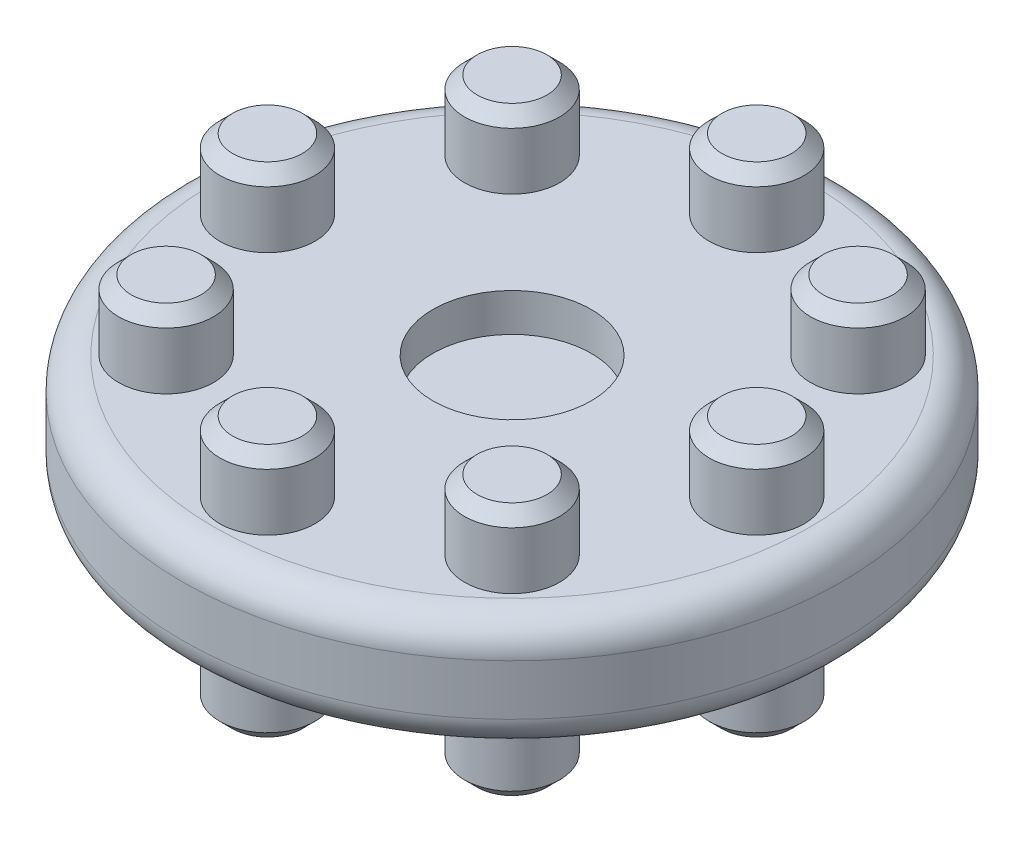
ISO-10303-21;
HEADER;
FILE_DESCRIPTION(('STEP AP214'),'2;1');
FILE_NAME('part.step','',(''),(''),'','','');
FILE_SCHEMA(('AUTOMOTIVE_DESIGN { 1 0 10303 214 1 1 1 1 }'));
ENDSEC;
DATA;
#1=APPLICATION_CONTEXT('core data for automotive mechanical design processes');
#2=APPLICATION_PROTOCOL_DEFINITION('international standard','automotive_design',2000,#1);
#3=PRODUCT_CONTEXT('',#1,'mechanical');
#4=PRODUCT('Part','Part','',(#3));
#5=PRODUCT_RELATED_PRODUCT_CATEGORY('part','',(#4));
#6=PRODUCT_DEFINITION_FORMATION('','',#4);
#7=PRODUCT_DEFINITION_CONTEXT('part definition',#1,'design');
#8=PRODUCT_DEFINITION('design','',#6,#7);
#9=PRODUCT_DEFINITION_SHAPE('','',#8);
#10=(LENGTH_UNIT() NAMED_UNIT(*) SI_UNIT(.MILLI.,.METRE.));
#11=(NAMED_UNIT(*) PLANE_ANGLE_UNIT() SI_UNIT($,.RADIAN.));
#12=(NAMED_UNIT(*) SI_UNIT($,.STERADIAN.) SOLID_ANGLE_UNIT());
#13=UNCERTAINTY_MEASURE_WITH_UNIT(LENGTH_MEASURE(1.E-05),#10,'distance_accuracy_value','');
#14=(GEOMETRIC_REPRESENTATION_CONTEXT(3) GLOBAL_UNCERTAINTY_ASSIGNED_CONTEXT((#13)) GLOBAL_UNIT_ASSIGNED_CONTEXT((#10,
#11,#12)) REPRESENTATION_CONTEXT('',''));
#15=CARTESIAN_POINT('',(0.,0.,0.));
#16=DIRECTION('',(0.,0.,1.));
#17=DIRECTION('',(1.,0.,0.));
#18=AXIS2_PLACEMENT_3D('',#15,#16,#17);
#19=CARTESIAN_POINT('',(0.,9.,0.));
#20=DIRECTION('',(0.,-1.,0.));
#21=DIRECTION('',(0.,0.,-1.));
#22=AXIS2_PLACEMENT_3D('',#19,#20,#21);
#23=CYLINDRICAL_SURFACE('',#22,26.);
#24=CARTESIAN_POINT('',(0.,2.5,0.));
#25=DIRECTION('',(0.,1.,0.));
#26=DIRECTION('',(0.,0.,1.));
#27=AXIS2_PLACEMENT_3D('',#24,#25,#26);
#28=CIRCLE('',#27,26.);
#29=CARTESIAN_POINT('',(0.,2.5,26.));
#30=VERTEX_POINT('',#29);
#31=EDGE_CURVE('E52',#30,#30,#28,.T.);
#32=ORIENTED_EDGE('',*,*,#31,.T.);
#33=EDGE_LOOP('',(#32));
#34=FACE_BOUND('',#33,.T.);
#35=CARTESIAN_POINT('',(0.,6.5,0.));
#36=DIRECTION('',(0.,1.,0.));
#37=DIRECTION('',(0.,0.,1.));
#38=AXIS2_PLACEMENT_3D('',#35,#36,#37);
#39=CIRCLE('',#38,26.);
#40=CARTESIAN_POINT('',(0.,6.5,26.));
#41=VERTEX_POINT('',#40);
#42=EDGE_CURVE('E57',#41,#41,#39,.F.);
#43=ORIENTED_EDGE('',*,*,#42,.T.);
#44=EDGE_LOOP('',(#43));
#45=FACE_BOUND('',#44,.T.);
#46=ADVANCED_FACE('F39',(#34,#45),#23,.T.);
#47=CARTESIAN_POINT('',(0.,9.,0.));
#48=DIRECTION('',(0.,1.,0.));
#49=DIRECTION('',(0.,0.,1.));
#50=AXIS2_PLACEMENT_3D('',#47,#48,#49);
#51=PLANE('',#50);
#52=CARTESIAN_POINT('',(0.,9.,0.));
#53=DIRECTION('',(0.,1.,0.));
#54=DIRECTION('',(0.,0.,1.));
#55=AXIS2_PLACEMENT_3D('',#52,#53,#54);
#56=CIRCLE('',#55,23.5);
#57=CARTESIAN_POINT('',(0.,9.,23.5));
#58=VERTEX_POINT('',#57);
#59=EDGE_CURVE('E10',#58,#58,#56,.T.);
#60=ORIENTED_EDGE('',*,*,#59,.T.);
#61=EDGE_LOOP('',(#60));
#62=FACE_BOUND('',#61,.T.);
#63=CARTESIAN_POINT('',(-13.6471608769004,9.,13.6471608769004));
#64=DIRECTION('',(0.,1.,0.));
#65=DIRECTION('',(0.,0.,1.));
#66=AXIS2_PLACEMENT_3D('',#63,#64,#65);
#67=CIRCLE('',#66,3.75);
#68=CARTESIAN_POINT('',(-13.6471608769004,9.,17.3971608769004));
#69=VERTEX_POINT('',#68);
#70=EDGE_CURVE('E267',#69,#69,#67,.T.);
#71=ORIENTED_EDGE('',*,*,#70,.F.);
#72=EDGE_LOOP('',(#71));
#73=FACE_BOUND('',#72,.T.);
#74=CARTESIAN_POINT('',(-19.3,9.,0.));
#75=DIRECTION('',(0.,1.,0.));
#76=DIRECTION('',(0.,0.,1.));
#77=AXIS2_PLACEMENT_3D('',#74,#75,#76);
#78=CIRCLE('',#77,3.75);
#79=CARTESIAN_POINT('',(-19.3,9.,3.75));
#80=VERTEX_POINT('',#79);
#81=EDGE_CURVE('E263',#80,#80,#78,.T.);
#82=ORIENTED_EDGE('',*,*,#81,.F.);
#83=EDGE_LOOP('',(#82));
#84=FACE_BOUND('',#83,.T.);
#85=CARTESIAN_POINT('',(13.6471608769004,9.,13.6471608769004));
#86=DIRECTION('',(0.,1.,0.));
#87=DIRECTION('',(0.,0.,1.));
#88=AXIS2_PLACEMENT_3D('',#85,#86,#87);
#89=CIRCLE('',#88,3.75);
#90=CARTESIAN_POINT('',(13.6471608769004,9.,17.3971608769004));
#91=VERTEX_POINT('',#90);
#92=EDGE_CURVE('E259',#91,#91,#89,.T.);
#93=ORIENTED_EDGE('',*,*,#92,.F.);
#94=EDGE_LOOP('',(#93));
#95=FACE_BOUND('',#94,.T.);
#96=CARTESIAN_POINT('',(0.,9.,19.3));
#97=DIRECTION('',(0.,1.,0.));
#98=DIRECTION('',(0.,0.,1.));
#99=AXIS2_PLACEMENT_3D('',#96,#97,#98);
#100=CIRCLE('',#99,3.75);
#101=CARTESIAN_POINT('',(0.,9.,23.05));
#102=VERTEX_POINT('',#101);
#103=EDGE_CURVE('E255',#102,#102,#100,.T.);
#104=ORIENTED_EDGE('',*,*,#103,.F.);
#105=EDGE_LOOP('',(#104));
#106=FACE_BOUND('',#105,.T.);
#107=CARTESIAN_POINT('',(-13.6471608769,9.,-13.6471608769002));
#108=DIRECTION('',(0.,1.,0.));
#109=DIRECTION('',(0.,0.,1.));
#110=AXIS2_PLACEMENT_3D('',#107,#108,#109);
#111=CIRCLE('',#110,3.75);
#112=CARTESIAN_POINT('',(-13.6471608769,9.,-9.89716087690015));
#113=VERTEX_POINT('',#112);
#114=EDGE_CURVE('E251',#113,#113,#111,.T.);
#115=ORIENTED_EDGE('',*,*,#114,.F.);
#116=EDGE_LOOP('',(#115));
#117=FACE_BOUND('',#116,.T.);
#118=CARTESIAN_POINT('',(0.,9.,-19.3));
#119=DIRECTION('',(0.,1.,0.));
#120=DIRECTION('',(0.,0.,1.));
#121=AXIS2_PLACEMENT_3D('',#118,#119,#120);
#122=CIRCLE('',#121,3.75);
#123=CARTESIAN_POINT('',(0.,9.,-15.55));
#124=VERTEX_POINT('',#123);
#125=EDGE_CURVE('E247',#124,#124,#122,.T.);
#126=ORIENTED_EDGE('',*,*,#125,.F.);
#127=EDGE_LOOP('',(#126));
#128=FACE_BOUND('',#127,.T.);
#129=CARTESIAN_POINT('',(13.6471608769005,9.,-13.6471608769007));
#130=DIRECTION('',(0.,1.,0.));
#131=DIRECTION('',(0.,0.,1.));
#132=AXIS2_PLACEMENT_3D('',#129,#130,#131);
#133=CIRCLE('',#132,3.75);
#134=CARTESIAN_POINT('',(13.6471608769005,9.,-9.89716087690073));
#135=VERTEX_POINT('',#134);
#136=EDGE_CURVE('E243',#135,#135,#133,.T.);
#137=ORIENTED_EDGE('',*,*,#136,.F.);
#138=EDGE_LOOP('',(#137));
#139=FACE_BOUND('',#138,.T.);
#140=CARTESIAN_POINT('',(19.3,9.,0.));
#141=DIRECTION('',(0.,1.,0.));
#142=DIRECTION('',(0.,0.,1.));
#143=AXIS2_PLACEMENT_3D('',#140,#141,#142);
#144=CIRCLE('',#143,3.75);
#145=CARTESIAN_POINT('',(19.3,9.,3.75));
#146=VERTEX_POINT('',#145);
#147=EDGE_CURVE('E239',#146,#146,#144,.T.);
#148=ORIENTED_EDGE('',*,*,#147,.F.);
#149=EDGE_LOOP('',(#148));
#150=FACE_BOUND('',#149,.T.);
#151=CARTESIAN_POINT('',(0.,9.,0.));
#152=DIRECTION('',(0.,1.,0.));
#153=DIRECTION('',(0.,0.,1.));
#154=AXIS2_PLACEMENT_3D('',#151,#152,#153);
#155=CIRCLE('',#154,6.25);
#156=CARTESIAN_POINT('',(0.,9.,6.25));
#157=VERTEX_POINT('',#156);
#158=EDGE_CURVE('E200',#157,#157,#155,.T.);
#159=ORIENTED_EDGE('',*,*,#158,.F.);
#160=EDGE_LOOP('',(#159));
#161=FACE_BOUND('',#160,.T.);
#162=ADVANCED_FACE('F274',(#62,#73,#84,#95,#106,#117,#128,#139,#150,#161),#51,.T.);
#163=CARTESIAN_POINT('',(0.,0.,0.));
#164=DIRECTION('',(0.,1.,0.));
#165=DIRECTION('',(0.,0.,1.));
#166=AXIS2_PLACEMENT_3D('',#163,#164,#165);
#167=PLANE('',#166);
#168=CARTESIAN_POINT('',(0.,0.,0.));
#169=DIRECTION('',(0.,1.,0.));
#170=DIRECTION('',(0.,0.,1.));
#171=AXIS2_PLACEMENT_3D('',#168,#169,#170);
#172=CIRCLE('',#171,23.5);
#173=CARTESIAN_POINT('',(0.,0.,23.5));
#174=VERTEX_POINT('',#173);
#175=EDGE_CURVE('E47',#174,#174,#172,.F.);
#176=ORIENTED_EDGE('',*,*,#175,.T.);
#177=EDGE_LOOP('',(#176));
#178=FACE_BOUND('',#177,.T.);
#179=CARTESIAN_POINT('',(-19.3,0.,0.));
#180=DIRECTION('',(0.,1.,0.));
#181=DIRECTION('',(0.,0.,1.));
#182=AXIS2_PLACEMENT_3D('',#179,#180,#181);
#183=CIRCLE('',#182,3.75);
#184=CARTESIAN_POINT('',(-19.3,0.,3.75));
#185=VERTEX_POINT('',#184);
#186=EDGE_CURVE('E235',#185,#185,#183,.T.);
#187=ORIENTED_EDGE('',*,*,#186,.T.);
#188=EDGE_LOOP('',(#187));
#189=FACE_BOUND('',#188,.T.);
#190=CARTESIAN_POINT('',(-13.6471608769004,0.,13.6471608769004));
#191=DIRECTION('',(0.,1.,0.));
#192=DIRECTION('',(0.,0.,1.));
#193=AXIS2_PLACEMENT_3D('',#190,#191,#192);
#194=CIRCLE('',#193,3.75);
#195=CARTESIAN_POINT('',(-13.6471608769004,0.,17.3971608769004));
#196=VERTEX_POINT('',#195);
#197=EDGE_CURVE('E231',#196,#196,#194,.T.);
#198=ORIENTED_EDGE('',*,*,#197,.T.);
#199=EDGE_LOOP('',(#198));
#200=FACE_BOUND('',#199,.T.);
#201=CARTESIAN_POINT('',(0.,0.,19.3));
#202=DIRECTION('',(0.,1.,0.));
#203=DIRECTION('',(0.,0.,1.));
#204=AXIS2_PLACEMENT_3D('',#201,#202,#203);
#205=CIRCLE('',#204,3.75);
#206=CARTESIAN_POINT('',(0.,0.,23.05));
#207=VERTEX_POINT('',#206);
#208=EDGE_CURVE('E227',#207,#207,#205,.T.);
#209=ORIENTED_EDGE('',*,*,#208,.T.);
#210=EDGE_LOOP('',(#209));
#211=FACE_BOUND('',#210,.T.);
#212=CARTESIAN_POINT('',(13.6471608769004,0.,13.6471608769004));
#213=DIRECTION('',(0.,1.,0.));
#214=DIRECTION('',(0.,0.,1.));
#215=AXIS2_PLACEMENT_3D('',#212,#213,#214);
#216=CIRCLE('',#215,3.75);
#217=CARTESIAN_POINT('',(13.6471608769004,0.,17.3971608769004));
#218=VERTEX_POINT('',#217);
#219=EDGE_CURVE('E223',#218,#218,#216,.T.);
#220=ORIENTED_EDGE('',*,*,#219,.T.);
#221=EDGE_LOOP('',(#220));
#222=FACE_BOUND('',#221,.T.);
#223=CARTESIAN_POINT('',(19.3,0.,0.));
#224=DIRECTION('',(0.,1.,0.));
#225=DIRECTION('',(0.,0.,1.));
#226=AXIS2_PLACEMENT_3D('',#223,#224,#225);
#227=CIRCLE('',#226,3.75);
#228=CARTESIAN_POINT('',(19.3,0.,3.75));
#229=VERTEX_POINT('',#228);
#230=EDGE_CURVE('E219',#229,#229,#227,.T.);
#231=ORIENTED_EDGE('',*,*,#230,.T.);
#232=EDGE_LOOP('',(#231));
#233=FACE_BOUND('',#232,.T.);
#234=CARTESIAN_POINT('',(13.6471608769005,0.,-13.6471608769007));
#235=DIRECTION('',(0.,1.,0.));
#236=DIRECTION('',(0.,0.,1.));
#237=AXIS2_PLACEMENT_3D('',#234,#235,#236);
#238=CIRCLE('',#237,3.75);
#239=CARTESIAN_POINT('',(13.6471608769005,0.,-9.89716087690073));
#240=VERTEX_POINT('',#239);
#241=EDGE_CURVE('E215',#240,#240,#238,.T.);
#242=ORIENTED_EDGE('',*,*,#241,.T.);
#243=EDGE_LOOP('',(#242));
#244=FACE_BOUND('',#243,.T.);
#245=CARTESIAN_POINT('',(0.,0.,-19.3));
#246=DIRECTION('',(0.,1.,0.));
#247=DIRECTION('',(0.,0.,1.));
#248=AXIS2_PLACEMENT_3D('',#245,#246,#247);
#249=CIRCLE('',#248,3.75);
#250=CARTESIAN_POINT('',(0.,0.,-15.55));
#251=VERTEX_POINT('',#250);
#252=EDGE_CURVE('E211',#251,#251,#249,.T.);
#253=ORIENTED_EDGE('',*,*,#252,.T.);
#254=EDGE_LOOP('',(#253));
#255=FACE_BOUND('',#254,.T.);
#256=CARTESIAN_POINT('',(-13.6471608769,0.,-13.6471608769002));
#257=DIRECTION('',(0.,1.,0.));
#258=DIRECTION('',(0.,0.,1.));
#259=AXIS2_PLACEMENT_3D('',#256,#257,#258);
#260=CIRCLE('',#259,3.75);
#261=CARTESIAN_POINT('',(-13.6471608769,0.,-9.89716087690015));
#262=VERTEX_POINT('',#261);
#263=EDGE_CURVE('E204',#262,#262,#260,.T.);
#264=ORIENTED_EDGE('',*,*,#263,.T.);
#265=EDGE_LOOP('',(#264));
#266=FACE_BOUND('',#265,.T.);
#267=CARTESIAN_POINT('',(0.,0.,0.));
#268=DIRECTION('',(0.,-1.,0.));
#269=DIRECTION('',(0.,0.,-1.));
#270=AXIS2_PLACEMENT_3D('',#267,#268,#269);
#271=CIRCLE('',#270,6.1);
#272=CARTESIAN_POINT('',(0.,0.,-6.1));
#273=VERTEX_POINT('',#272);
#274=EDGE_CURVE('E192',#273,#273,#271,.T.);
#275=ORIENTED_EDGE('',*,*,#274,.F.);
#276=EDGE_LOOP('',(#275));
#277=FACE_BOUND('',#276,.T.);
#278=ADVANCED_FACE('F277',(#178,#189,#200,#211,#222,#233,#244,#255,#266,#277),#167,.F.);
#279=CARTESIAN_POINT('',(0.,3.,0.));
#280=DIRECTION('',(0.,-1.,0.));
#281=DIRECTION('',(0.,0.,-1.));
#282=AXIS2_PLACEMENT_3D('',#279,#280,#281);
#283=CYLINDRICAL_SURFACE('',#282,6.1);
#284=CARTESIAN_POINT('',(0.,3.,0.));
#285=DIRECTION('',(0.,-1.,0.));
#286=DIRECTION('',(0.,0.,-1.));
#287=AXIS2_PLACEMENT_3D('',#284,#285,#286);
#288=CIRCLE('',#287,6.1);
#289=CARTESIAN_POINT('',(0.,3.,-6.1));
#290=VERTEX_POINT('',#289);
#291=EDGE_CURVE('E191',#290,#290,#288,.T.);
#292=ORIENTED_EDGE('',*,*,#291,.F.);
#293=EDGE_LOOP('',(#292));
#294=FACE_BOUND('',#293,.T.);
#295=ORIENTED_EDGE('',*,*,#274,.T.);
#296=EDGE_LOOP('',(#295));
#297=FACE_BOUND('',#296,.T.);
#298=ADVANCED_FACE('F308',(#294,#297),#283,.F.);
#299=CARTESIAN_POINT('',(0.,3.,0.));
#300=DIRECTION('',(0.,-1.,0.));
#301=DIRECTION('',(0.,0.,-1.));
#302=AXIS2_PLACEMENT_3D('',#299,#300,#301);
#303=PLANE('',#302);
#304=ORIENTED_EDGE('',*,*,#291,.T.);
#305=EDGE_LOOP('',(#304));
#306=FACE_BOUND('',#305,.T.);
#307=ADVANCED_FACE('F298',(#306),#303,.T.);
#308=CARTESIAN_POINT('',(0.,6.,0.));
#309=DIRECTION('',(0.,1.,0.));
#310=DIRECTION('',(0.,0.,1.));
#311=AXIS2_PLACEMENT_3D('',#308,#309,#310);
#312=CYLINDRICAL_SURFACE('',#311,6.25);
#313=CARTESIAN_POINT('',(0.,6.,0.));
#314=DIRECTION('',(0.,1.,0.));
#315=DIRECTION('',(0.,0.,1.));
#316=AXIS2_PLACEMENT_3D('',#313,#314,#315);
#317=CIRCLE('',#316,6.25);
#318=CARTESIAN_POINT('',(0.,6.,6.25));
#319=VERTEX_POINT('',#318);
#320=EDGE_CURVE('E196',#319,#319,#317,.T.);
#321=ORIENTED_EDGE('',*,*,#320,.F.);
#322=EDGE_LOOP('',(#321));
#323=FACE_BOUND('',#322,.T.);
#324=ORIENTED_EDGE('',*,*,#158,.T.);
#325=EDGE_LOOP('',(#324));
#326=FACE_BOUND('',#325,.T.);
#327=ADVANCED_FACE('F295',(#323,#326),#312,.F.);
#328=CARTESIAN_POINT('',(0.,6.,0.));
#329=DIRECTION('',(0.,1.,0.));
#330=DIRECTION('',(0.,0.,1.));
#331=AXIS2_PLACEMENT_3D('',#328,#329,#330);
#332=PLANE('',#331);
#333=ORIENTED_EDGE('',*,*,#320,.T.);
#334=EDGE_LOOP('',(#333));
#335=FACE_BOUND('',#334,.T.);
#336=ADVANCED_FACE('F297',(#335),#332,.T.);
#337=CARTESIAN_POINT('',(-13.6471608769,-5.5,-13.6471608769002));
#338=DIRECTION('',(0.,1.,0.));
#339=DIRECTION('',(0.,0.,1.));
#340=AXIS2_PLACEMENT_3D('',#337,#338,#339);
#341=CYLINDRICAL_SURFACE('',#340,3.75);
#342=CARTESIAN_POINT('',(-13.6471608769,-4.50000000000002,-13.6471608769002));
#343=DIRECTION('',(0.,1.,0.));
#344=DIRECTION('',(0.,0.,1.));
#345=AXIS2_PLACEMENT_3D('',#342,#343,#344);
#346=CIRCLE('',#345,3.75);
#347=CARTESIAN_POINT('',(-13.6471608769,-4.50000000000002,-9.89716087690015));
#348=VERTEX_POINT('',#347);
#349=EDGE_CURVE('E123',#348,#348,#346,.T.);
#350=ORIENTED_EDGE('',*,*,#349,.T.);
#351=EDGE_LOOP('',(#350));
#352=FACE_BOUND('',#351,.T.);
#353=ORIENTED_EDGE('',*,*,#263,.F.);
#354=EDGE_LOOP('',(#353));
#355=FACE_BOUND('',#354,.T.);
#356=ADVANCED_FACE('F305',(#352,#355),#341,.T.);
#357=CARTESIAN_POINT('',(-13.6471608769,-5.5,-13.6471608769002));
#358=DIRECTION('',(0.,1.,0.));
#359=DIRECTION('',(0.,0.,1.));
#360=AXIS2_PLACEMENT_3D('',#357,#358,#359);
#361=PLANE('',#360);
#362=CARTESIAN_POINT('',(-13.6471608769,-5.5,-13.6471608769002));
#363=DIRECTION('',(0.,1.,0.));
#364=DIRECTION('',(0.,0.,1.));
#365=AXIS2_PLACEMENT_3D('',#362,#363,#364);
#366=CIRCLE('',#365,2.75000000000001);
#367=CARTESIAN_POINT('',(-13.6471608769,-5.5,-10.8971608769001));
#368=VERTEX_POINT('',#367);
#369=EDGE_CURVE('E119',#368,#368,#366,.F.);
#370=ORIENTED_EDGE('',*,*,#369,.T.);
#371=EDGE_LOOP('',(#370));
#372=FACE_BOUND('',#371,.T.);
#373=ADVANCED_FACE('F862',(#372),#361,.F.);
#374=CARTESIAN_POINT('',(0.,-5.5,-19.3));
#375=DIRECTION('',(0.,1.,0.));
#376=DIRECTION('',(0.,0.,1.));
#377=AXIS2_PLACEMENT_3D('',#374,#375,#376);
#378=CYLINDRICAL_SURFACE('',#377,3.75);
#379=CARTESIAN_POINT('',(0.,-4.50000000000002,-19.3));
#380=DIRECTION('',(0.,1.,0.));
#381=DIRECTION('',(0.,0.,1.));
#382=AXIS2_PLACEMENT_3D('',#379,#380,#381);
#383=CIRCLE('',#382,3.75);
#384=CARTESIAN_POINT('',(0.,-4.50000000000002,-15.55));
#385=VERTEX_POINT('',#384);
#386=EDGE_CURVE('E131',#385,#385,#383,.T.);
#387=ORIENTED_EDGE('',*,*,#386,.T.);
#388=EDGE_LOOP('',(#387));
#389=FACE_BOUND('',#388,.T.);
#390=ORIENTED_EDGE('',*,*,#252,.F.);
#391=EDGE_LOOP('',(#390));
#392=FACE_BOUND('',#391,.T.);
#393=ADVANCED_FACE('F852',(#389,#392),#378,.T.);
#394=CARTESIAN_POINT('',(0.,-5.5,-19.3));
#395=DIRECTION('',(0.,1.,0.));
#396=DIRECTION('',(0.,0.,1.));
#397=AXIS2_PLACEMENT_3D('',#394,#395,#396);
#398=PLANE('',#397);
#399=CARTESIAN_POINT('',(0.,-5.5,-19.3));
#400=DIRECTION('',(0.,1.,0.));
#401=DIRECTION('',(0.,0.,1.));
#402=AXIS2_PLACEMENT_3D('',#399,#400,#401);
#403=CIRCLE('',#402,2.75000000000001);
#404=CARTESIAN_POINT('',(0.,-5.5,-16.55));
#405=VERTEX_POINT('',#404);
#406=EDGE_CURVE('E127',#405,#405,#403,.F.);
#407=ORIENTED_EDGE('',*,*,#406,.T.);
#408=EDGE_LOOP('',(#407));
#409=FACE_BOUND('',#408,.T.);
#410=ADVANCED_FACE('F842',(#409),#398,.F.);
#411=CARTESIAN_POINT('',(13.6471608769005,-5.5,-13.6471608769007));
#412=DIRECTION('',(0.,1.,0.));
#413=DIRECTION('',(0.,0.,1.));
#414=AXIS2_PLACEMENT_3D('',#411,#412,#413);
#415=CYLINDRICAL_SURFACE('',#414,3.75);
#416=CARTESIAN_POINT('',(13.6471608769005,-4.50000000000002,-13.6471608769007));
#417=DIRECTION('',(0.,1.,0.));
#418=DIRECTION('',(0.,0.,1.));
#419=AXIS2_PLACEMENT_3D('',#416,#417,#418);
#420=CIRCLE('',#419,3.75);
#421=CARTESIAN_POINT('',(13.6471608769005,-4.50000000000002,-9.89716087690073));
#422=VERTEX_POINT('',#421);
#423=EDGE_CURVE('E139',#422,#422,#420,.T.);
#424=ORIENTED_EDGE('',*,*,#423,.T.);
#425=EDGE_LOOP('',(#424));
#426=FACE_BOUND('',#425,.T.);
#427=ORIENTED_EDGE('',*,*,#241,.F.);
#428=EDGE_LOOP('',(#427));
#429=FACE_BOUND('',#428,.T.);
#430=ADVANCED_FACE('F832',(#426,#429),#415,.T.);
#431=CARTESIAN_POINT('',(13.6471608769005,-5.5,-13.6471608769007));
#432=DIRECTION('',(0.,1.,0.));
#433=DIRECTION('',(0.,0.,1.));
#434=AXIS2_PLACEMENT_3D('',#431,#432,#433);
#435=PLANE('',#434);
#436=CARTESIAN_POINT('',(13.6471608769005,-5.5,-13.6471608769007));
#437=DIRECTION('',(0.,1.,0.));
#438=DIRECTION('',(0.,0.,1.));
#439=AXIS2_PLACEMENT_3D('',#436,#437,#438);
#440=CIRCLE('',#439,2.75000000000001);
#441=CARTESIAN_POINT('',(13.6471608769005,-5.5,-10.8971608769007));
#442=VERTEX_POINT('',#441);
#443=EDGE_CURVE('E135',#442,#442,#440,.F.);
#444=ORIENTED_EDGE('',*,*,#443,.T.);
#445=EDGE_LOOP('',(#444));
#446=FACE_BOUND('',#445,.T.);
#447=ADVANCED_FACE('F822',(#446),#435,.F.);
#448=CARTESIAN_POINT('',(19.3,-5.5,0.));
#449=DIRECTION('',(0.,1.,0.));
#450=DIRECTION('',(0.,0.,1.));
#451=AXIS2_PLACEMENT_3D('',#448,#449,#450);
#452=CYLINDRICAL_SURFACE('',#451,3.75);
#453=CARTESIAN_POINT('',(19.3,-4.5,0.));
#454=DIRECTION('',(0.,1.,0.));
#455=DIRECTION('',(0.,0.,1.));
#456=AXIS2_PLACEMENT_3D('',#453,#454,#455);
#457=CIRCLE('',#456,3.75);
#458=CARTESIAN_POINT('',(19.3,-4.5,3.75));
#459=VERTEX_POINT('',#458);
#460=EDGE_CURVE('E147',#459,#459,#457,.T.);
#461=ORIENTED_EDGE('',*,*,#460,.T.);
#462=EDGE_LOOP('',(#461));
#463=FACE_BOUND('',#462,.T.);
#464=ORIENTED_EDGE('',*,*,#230,.F.);
#465=EDGE_LOOP('',(#464));
#466=FACE_BOUND('',#465,.T.);
#467=ADVANCED_FACE('F812',(#463,#466),#452,.T.);
#468=CARTESIAN_POINT('',(19.3,-5.5,0.));
#469=DIRECTION('',(0.,1.,0.));
#470=DIRECTION('',(0.,0.,1.));
#471=AXIS2_PLACEMENT_3D('',#468,#469,#470);
#472=PLANE('',#471);
#473=CARTESIAN_POINT('',(19.3,-5.5,0.));
#474=DIRECTION('',(0.,1.,0.));
#475=DIRECTION('',(0.,0.,1.));
#476=AXIS2_PLACEMENT_3D('',#473,#474,#475);
#477=CIRCLE('',#476,2.75);
#478=CARTESIAN_POINT('',(19.3,-5.5,2.75));
#479=VERTEX_POINT('',#478);
#480=EDGE_CURVE('E143',#479,#479,#477,.F.);
#481=ORIENTED_EDGE('',*,*,#480,.T.);
#482=EDGE_LOOP('',(#481));
#483=FACE_BOUND('',#482,.T.);
#484=ADVANCED_FACE('F802',(#483),#472,.F.);
#485=CARTESIAN_POINT('',(13.6471608769004,-5.5,13.6471608769004));
#486=DIRECTION('',(0.,1.,0.));
#487=DIRECTION('',(0.,0.,1.));
#488=AXIS2_PLACEMENT_3D('',#485,#486,#487);
#489=CYLINDRICAL_SURFACE('',#488,3.75);
#490=CARTESIAN_POINT('',(13.6471608769004,-4.50000000000002,13.6471608769004));
#491=DIRECTION('',(0.,1.,0.));
#492=DIRECTION('',(0.,0.,1.));
#493=AXIS2_PLACEMENT_3D('',#490,#491,#492);
#494=CIRCLE('',#493,3.75);
#495=CARTESIAN_POINT('',(13.6471608769004,-4.50000000000002,17.3971608769004));
#496=VERTEX_POINT('',#495);
#497=EDGE_CURVE('E155',#496,#496,#494,.T.);
#498=ORIENTED_EDGE('',*,*,#497,.T.);
#499=EDGE_LOOP('',(#498));
#500=FACE_BOUND('',#499,.T.);
#501=ORIENTED_EDGE('',*,*,#219,.F.);
#502=EDGE_LOOP('',(#501));
#503=FACE_BOUND('',#502,.T.);
#504=ADVANCED_FACE('F792',(#500,#503),#489,.T.);
#505=CARTESIAN_POINT('',(13.6471608769004,-5.5,13.6471608769004));
#506=DIRECTION('',(0.,1.,0.));
#507=DIRECTION('',(0.,0.,1.));
#508=AXIS2_PLACEMENT_3D('',#505,#506,#507);
#509=PLANE('',#508);
#510=CARTESIAN_POINT('',(13.6471608769004,-5.5,13.6471608769004));
#511=DIRECTION('',(0.,1.,0.));
#512=DIRECTION('',(0.,0.,1.));
#513=AXIS2_PLACEMENT_3D('',#510,#511,#512);
#514=CIRCLE('',#513,2.75000000000001);
#515=CARTESIAN_POINT('',(13.6471608769004,-5.5,16.3971608769004));
#516=VERTEX_POINT('',#515);
#517=EDGE_CURVE('E151',#516,#516,#514,.F.);
#518=ORIENTED_EDGE('',*,*,#517,.T.);
#519=EDGE_LOOP('',(#518));
#520=FACE_BOUND('',#519,.T.);
#521=ADVANCED_FACE('F782',(#520),#509,.F.);
#522=CARTESIAN_POINT('',(0.,-5.5,19.3));
#523=DIRECTION('',(0.,1.,0.));
#524=DIRECTION('',(0.,0.,1.));
#525=AXIS2_PLACEMENT_3D('',#522,#523,#524);
#526=CYLINDRICAL_SURFACE('',#525,3.75);
#527=CARTESIAN_POINT('',(0.,-4.50000000000002,19.3));
#528=DIRECTION('',(0.,1.,0.));
#529=DIRECTION('',(0.,0.,1.));
#530=AXIS2_PLACEMENT_3D('',#527,#528,#529);
#531=CIRCLE('',#530,3.75);
#532=CARTESIAN_POINT('',(0.,-4.50000000000002,23.05));
#533=VERTEX_POINT('',#532);
#534=EDGE_CURVE('E163',#533,#533,#531,.T.);
#535=ORIENTED_EDGE('',*,*,#534,.T.);
#536=EDGE_LOOP('',(#535));
#537=FACE_BOUND('',#536,.T.);
#538=ORIENTED_EDGE('',*,*,#208,.F.);
#539=EDGE_LOOP('',(#538));
#540=FACE_BOUND('',#539,.T.);
#541=ADVANCED_FACE('F772',(#537,#540),#526,.T.);
#542=CARTESIAN_POINT('',(0.,-5.5,19.3));
#543=DIRECTION('',(0.,1.,0.));
#544=DIRECTION('',(0.,0.,1.));
#545=AXIS2_PLACEMENT_3D('',#542,#543,#544);
#546=PLANE('',#545);
#547=CARTESIAN_POINT('',(0.,-5.5,19.3));
#548=DIRECTION('',(0.,1.,0.));
#549=DIRECTION('',(0.,0.,1.));
#550=AXIS2_PLACEMENT_3D('',#547,#548,#549);
#551=CIRCLE('',#550,2.75000000000001);
#552=CARTESIAN_POINT('',(0.,-5.5,22.05));
#553=VERTEX_POINT('',#552);
#554=EDGE_CURVE('E159',#553,#553,#551,.F.);
#555=ORIENTED_EDGE('',*,*,#554,.T.);
#556=EDGE_LOOP('',(#555));
#557=FACE_BOUND('',#556,.T.);
#558=ADVANCED_FACE('F762',(#557),#546,.F.);
#559=CARTESIAN_POINT('',(-13.6471608769004,-5.5,13.6471608769004));
#560=DIRECTION('',(0.,1.,0.));
#561=DIRECTION('',(0.,0.,1.));
#562=AXIS2_PLACEMENT_3D('',#559,#560,#561);
#563=CYLINDRICAL_SURFACE('',#562,3.75);
#564=CARTESIAN_POINT('',(-13.6471608769004,-4.5,13.6471608769004));
#565=DIRECTION('',(0.,1.,0.));
#566=DIRECTION('',(0.,0.,1.));
#567=AXIS2_PLACEMENT_3D('',#564,#565,#566);
#568=CIRCLE('',#567,3.75);
#569=CARTESIAN_POINT('',(-13.6471608769004,-4.5,17.3971608769004));
#570=VERTEX_POINT('',#569);
#571=EDGE_CURVE('E171',#570,#570,#568,.T.);
#572=ORIENTED_EDGE('',*,*,#571,.T.);
#573=EDGE_LOOP('',(#572));
#574=FACE_BOUND('',#573,.T.);
#575=ORIENTED_EDGE('',*,*,#197,.F.);
#576=EDGE_LOOP('',(#575));
#577=FACE_BOUND('',#576,.T.);
#578=ADVANCED_FACE('F752',(#574,#577),#563,.T.);
#579=CARTESIAN_POINT('',(-13.6471608769004,-5.5,13.6471608769004));
#580=DIRECTION('',(0.,1.,0.));
#581=DIRECTION('',(0.,0.,1.));
#582=AXIS2_PLACEMENT_3D('',#579,#580,#581);
#583=PLANE('',#582);
#584=CARTESIAN_POINT('',(-13.6471608769004,-5.5,13.6471608769004));
#585=DIRECTION('',(0.,1.,0.));
#586=DIRECTION('',(0.,0.,1.));
#587=AXIS2_PLACEMENT_3D('',#584,#585,#586);
#588=CIRCLE('',#587,2.75);
#589=CARTESIAN_POINT('',(-13.6471608769004,-5.5,16.3971608769004));
#590=VERTEX_POINT('',#589);
#591=EDGE_CURVE('E167',#590,#590,#588,.F.);
#592=ORIENTED_EDGE('',*,*,#591,.T.);
#593=EDGE_LOOP('',(#592));
#594=FACE_BOUND('',#593,.T.);
#595=ADVANCED_FACE('F742',(#594),#583,.F.);
#596=CARTESIAN_POINT('',(-19.3,-5.5,0.));
#597=DIRECTION('',(0.,1.,0.));
#598=DIRECTION('',(0.,0.,1.));
#599=AXIS2_PLACEMENT_3D('',#596,#597,#598);
#600=CYLINDRICAL_SURFACE('',#599,3.75);
#601=CARTESIAN_POINT('',(-19.3,-4.5,0.));
#602=DIRECTION('',(0.,1.,0.));
#603=DIRECTION('',(0.,0.,1.));
#604=AXIS2_PLACEMENT_3D('',#601,#602,#603);
#605=CIRCLE('',#604,3.75);
#606=CARTESIAN_POINT('',(-19.3,-4.5,3.75));
#607=VERTEX_POINT('',#606);
#608=EDGE_CURVE('E179',#607,#607,#605,.T.);
#609=ORIENTED_EDGE('',*,*,#608,.T.);
#610=EDGE_LOOP('',(#609));
#611=FACE_BOUND('',#610,.T.);
#612=ORIENTED_EDGE('',*,*,#186,.F.);
#613=EDGE_LOOP('',(#612));
#614=FACE_BOUND('',#613,.T.);
#615=ADVANCED_FACE('F732',(#611,#614),#600,.T.);
#616=CARTESIAN_POINT('',(-19.3,-5.5,0.));
#617=DIRECTION('',(0.,1.,0.));
#618=DIRECTION('',(0.,0.,1.));
#619=AXIS2_PLACEMENT_3D('',#616,#617,#618);
#620=PLANE('',#619);
#621=CARTESIAN_POINT('',(-19.3,-5.5,0.));
#622=DIRECTION('',(0.,1.,0.));
#623=DIRECTION('',(0.,0.,1.));
#624=AXIS2_PLACEMENT_3D('',#621,#622,#623);
#625=CIRCLE('',#624,2.75);
#626=CARTESIAN_POINT('',(-19.3,-5.5,2.75));
#627=VERTEX_POINT('',#626);
#628=EDGE_CURVE('E175',#627,#627,#625,.F.);
#629=ORIENTED_EDGE('',*,*,#628,.T.);
#630=EDGE_LOOP('',(#629));
#631=FACE_BOUND('',#630,.T.);
#632=ADVANCED_FACE('F722',(#631),#620,.F.);
#633=CARTESIAN_POINT('',(19.3,14.5,0.));
#634=DIRECTION('',(0.,-1.,0.));
#635=DIRECTION('',(0.,0.,-1.));
#636=AXIS2_PLACEMENT_3D('',#633,#634,#635);
#637=CYLINDRICAL_SURFACE('',#636,3.75);
#638=CARTESIAN_POINT('',(19.3,13.5,0.));
#639=DIRECTION('',(0.,1.,0.));
#640=DIRECTION('',(0.,0.,1.));
#641=AXIS2_PLACEMENT_3D('',#638,#639,#640);
#642=CIRCLE('',#641,3.75);
#643=CARTESIAN_POINT('',(19.3,13.5,3.75));
#644=VERTEX_POINT('',#643);
#645=EDGE_CURVE('E79',#644,#644,#642,.F.);
#646=ORIENTED_EDGE('',*,*,#645,.T.);
#647=EDGE_LOOP('',(#646));
#648=FACE_BOUND('',#647,.T.);
#649=ORIENTED_EDGE('',*,*,#147,.T.);
#650=EDGE_LOOP('',(#649));
#651=FACE_BOUND('',#650,.T.);
#652=ADVANCED_FACE('F712',(#648,#651),#637,.T.);
#653=CARTESIAN_POINT('',(19.3,14.5,0.));
#654=DIRECTION('',(0.,1.,0.));
#655=DIRECTION('',(0.,0.,1.));
#656=AXIS2_PLACEMENT_3D('',#653,#654,#655);
#657=PLANE('',#656);
#658=CARTESIAN_POINT('',(19.3,14.5,0.));
#659=DIRECTION('',(0.,1.,0.));
#660=DIRECTION('',(0.,0.,1.));
#661=AXIS2_PLACEMENT_3D('',#658,#659,#660);
#662=CIRCLE('',#661,2.75000000000001);
#663=CARTESIAN_POINT('',(19.3,14.5,2.75000000000001));
#664=VERTEX_POINT('',#663);
#665=EDGE_CURVE('E83',#664,#664,#662,.T.);
#666=ORIENTED_EDGE('',*,*,#665,.T.);
#667=EDGE_LOOP('',(#666));
#668=FACE_BOUND('',#667,.T.);
#669=ADVANCED_FACE('F702',(#668),#657,.T.);
#670=CARTESIAN_POINT('',(13.6471608769005,14.5,-13.6471608769007));
#671=DIRECTION('',(0.,-1.,0.));
#672=DIRECTION('',(0.,0.,-1.));
#673=AXIS2_PLACEMENT_3D('',#670,#671,#672);
#674=CYLINDRICAL_SURFACE('',#673,3.75);
#675=CARTESIAN_POINT('',(13.6471608769005,13.5,-13.6471608769007));
#676=DIRECTION('',(0.,1.,0.));
#677=DIRECTION('',(0.,0.,1.));
#678=AXIS2_PLACEMENT_3D('',#675,#676,#677);
#679=CIRCLE('',#678,3.75);
#680=CARTESIAN_POINT('',(13.6471608769005,13.5,-9.89716087690073));
#681=VERTEX_POINT('',#680);
#682=EDGE_CURVE('E183',#681,#681,#679,.F.);
#683=ORIENTED_EDGE('',*,*,#682,.T.);
#684=EDGE_LOOP('',(#683));
#685=FACE_BOUND('',#684,.T.);
#686=ORIENTED_EDGE('',*,*,#136,.T.);
#687=EDGE_LOOP('',(#686));
#688=FACE_BOUND('',#687,.T.);
#689=ADVANCED_FACE('F692',(#685,#688),#674,.T.);
#690=CARTESIAN_POINT('',(13.6471608769005,14.5,-13.6471608769007));
#691=DIRECTION('',(0.,1.,0.));
#692=DIRECTION('',(0.,0.,1.));
#693=AXIS2_PLACEMENT_3D('',#690,#691,#692);
#694=PLANE('',#693);
#695=CARTESIAN_POINT('',(13.6471608769005,14.5,-13.6471608769007));
#696=DIRECTION('',(0.,1.,0.));
#697=DIRECTION('',(0.,0.,1.));
#698=AXIS2_PLACEMENT_3D('',#695,#696,#697);
#699=CIRCLE('',#698,2.75000000000002);
#700=CARTESIAN_POINT('',(13.6471608769005,14.5,-10.8971608769007));
#701=VERTEX_POINT('',#700);
#702=EDGE_CURVE('E187',#701,#701,#699,.T.);
#703=ORIENTED_EDGE('',*,*,#702,.T.);
#704=EDGE_LOOP('',(#703));
#705=FACE_BOUND('',#704,.T.);
#706=ADVANCED_FACE('F682',(#705),#694,.T.);
#707=CARTESIAN_POINT('',(0.,14.5,-19.3));
#708=DIRECTION('',(0.,-1.,0.));
#709=DIRECTION('',(0.,0.,-1.));
#710=AXIS2_PLACEMENT_3D('',#707,#708,#709);
#711=CYLINDRICAL_SURFACE('',#710,3.75);
#712=CARTESIAN_POINT('',(0.,13.5,-19.3));
#713=DIRECTION('',(0.,1.,0.));
#714=DIRECTION('',(0.,0.,1.));
#715=AXIS2_PLACEMENT_3D('',#712,#713,#714);
#716=CIRCLE('',#715,3.75);
#717=CARTESIAN_POINT('',(0.,13.5,-15.55));
#718=VERTEX_POINT('',#717);
#719=EDGE_CURVE('E71',#718,#718,#716,.F.);
#720=ORIENTED_EDGE('',*,*,#719,.T.);
#721=EDGE_LOOP('',(#720));
#722=FACE_BOUND('',#721,.T.);
#723=ORIENTED_EDGE('',*,*,#125,.T.);
#724=EDGE_LOOP('',(#723));
#725=FACE_BOUND('',#724,.T.);
#726=ADVANCED_FACE('F672',(#722,#725),#711,.T.);
#727=CARTESIAN_POINT('',(0.,14.5,-19.3));
#728=DIRECTION('',(0.,1.,0.));
#729=DIRECTION('',(0.,0.,1.));
#730=AXIS2_PLACEMENT_3D('',#727,#728,#729);
#731=PLANE('',#730);
#732=CARTESIAN_POINT('',(0.,14.5,-19.3));
#733=DIRECTION('',(0.,1.,0.));
#734=DIRECTION('',(0.,0.,1.));
#735=AXIS2_PLACEMENT_3D('',#732,#733,#734);
#736=CIRCLE('',#735,2.75000000000002);
#737=CARTESIAN_POINT('',(0.,14.5,-16.55));
#738=VERTEX_POINT('',#737);
#739=EDGE_CURVE('E75',#738,#738,#736,.T.);
#740=ORIENTED_EDGE('',*,*,#739,.T.);
#741=EDGE_LOOP('',(#740));
#742=FACE_BOUND('',#741,.T.);
#743=ADVANCED_FACE('F662',(#742),#731,.T.);
#744=CARTESIAN_POINT('',(-13.6471608769,14.5,-13.6471608769002));
#745=DIRECTION('',(0.,-1.,0.));
#746=DIRECTION('',(0.,0.,-1.));
#747=AXIS2_PLACEMENT_3D('',#744,#745,#746);
#748=CYLINDRICAL_SURFACE('',#747,3.75);
#749=CARTESIAN_POINT('',(-13.6471608769,13.5,-13.6471608769002));
#750=DIRECTION('',(0.,1.,0.));
#751=DIRECTION('',(0.,0.,1.));
#752=AXIS2_PLACEMENT_3D('',#749,#750,#751);
#753=CIRCLE('',#752,3.75);
#754=CARTESIAN_POINT('',(-13.6471608769,13.5,-9.89716087690015));
#755=VERTEX_POINT('',#754);
#756=EDGE_CURVE('E63',#755,#755,#753,.F.);
#757=ORIENTED_EDGE('',*,*,#756,.T.);
#758=EDGE_LOOP('',(#757));
#759=FACE_BOUND('',#758,.T.);
#760=ORIENTED_EDGE('',*,*,#114,.T.);
#761=EDGE_LOOP('',(#760));
#762=FACE_BOUND('',#761,.T.);
#763=ADVANCED_FACE('F652',(#759,#762),#748,.T.);
#764=CARTESIAN_POINT('',(-13.6471608769,14.5,-13.6471608769002));
#765=DIRECTION('',(0.,1.,0.));
#766=DIRECTION('',(0.,0.,1.));
#767=AXIS2_PLACEMENT_3D('',#764,#765,#766);
#768=PLANE('',#767);
#769=CARTESIAN_POINT('',(-13.6471608769,14.5,-13.6471608769002));
#770=DIRECTION('',(0.,1.,0.));
#771=DIRECTION('',(0.,0.,1.));
#772=AXIS2_PLACEMENT_3D('',#769,#770,#771);
#773=CIRCLE('',#772,2.75);
#774=CARTESIAN_POINT('',(-13.6471608769,14.5,-10.8971608769002));
#775=VERTEX_POINT('',#774);
#776=EDGE_CURVE('E67',#775,#775,#773,.T.);
#777=ORIENTED_EDGE('',*,*,#776,.T.);
#778=EDGE_LOOP('',(#777));
#779=FACE_BOUND('',#778,.T.);
#780=ADVANCED_FACE('F642',(#779),#768,.T.);
#781=CARTESIAN_POINT('',(0.,14.5,19.3));
#782=DIRECTION('',(0.,-1.,0.));
#783=DIRECTION('',(0.,0.,-1.));
#784=AXIS2_PLACEMENT_3D('',#781,#782,#783);
#785=CYLINDRICAL_SURFACE('',#784,3.75);
#786=CARTESIAN_POINT('',(0.,13.5,19.3));
#787=DIRECTION('',(0.,1.,0.));
#788=DIRECTION('',(0.,0.,1.));
#789=AXIS2_PLACEMENT_3D('',#786,#787,#788);
#790=CIRCLE('',#789,3.75);
#791=CARTESIAN_POINT('',(0.,13.5,23.05));
#792=VERTEX_POINT('',#791);
#793=EDGE_CURVE('E95',#792,#792,#790,.F.);
#794=ORIENTED_EDGE('',*,*,#793,.T.);
#795=EDGE_LOOP('',(#794));
#796=FACE_BOUND('',#795,.T.);
#797=ORIENTED_EDGE('',*,*,#103,.T.);
#798=EDGE_LOOP('',(#797));
#799=FACE_BOUND('',#798,.T.);
#800=ADVANCED_FACE('F632',(#796,#799),#785,.T.);
#801=CARTESIAN_POINT('',(0.,14.5,19.3));
#802=DIRECTION('',(0.,1.,0.));
#803=DIRECTION('',(0.,0.,1.));
#804=AXIS2_PLACEMENT_3D('',#801,#802,#803);
#805=PLANE('',#804);
#806=CARTESIAN_POINT('',(0.,14.5,19.3));
#807=DIRECTION('',(0.,1.,0.));
#808=DIRECTION('',(0.,0.,1.));
#809=AXIS2_PLACEMENT_3D('',#806,#807,#808);
#810=CIRCLE('',#809,2.75);
#811=CARTESIAN_POINT('',(0.,14.5,22.05));
#812=VERTEX_POINT('',#811);
#813=EDGE_CURVE('E99',#812,#812,#810,.T.);
#814=ORIENTED_EDGE('',*,*,#813,.T.);
#815=EDGE_LOOP('',(#814));
#816=FACE_BOUND('',#815,.T.);
#817=ADVANCED_FACE('F622',(#816),#805,.T.);
#818=CARTESIAN_POINT('',(13.6471608769004,14.5,13.6471608769004));
#819=DIRECTION('',(0.,-1.,0.));
#820=DIRECTION('',(0.,0.,-1.));
#821=AXIS2_PLACEMENT_3D('',#818,#819,#820);
#822=CYLINDRICAL_SURFACE('',#821,3.75);
#823=CARTESIAN_POINT('',(13.6471608769004,13.5,13.6471608769004));
#824=DIRECTION('',(0.,1.,0.));
#825=DIRECTION('',(0.,0.,1.));
#826=AXIS2_PLACEMENT_3D('',#823,#824,#825);
#827=CIRCLE('',#826,3.75);
#828=CARTESIAN_POINT('',(13.6471608769004,13.5,17.3971608769004));
#829=VERTEX_POINT('',#828);
#830=EDGE_CURVE('E87',#829,#829,#827,.F.);
#831=ORIENTED_EDGE('',*,*,#830,.T.);
#832=EDGE_LOOP('',(#831));
#833=FACE_BOUND('',#832,.T.);
#834=ORIENTED_EDGE('',*,*,#92,.T.);
#835=EDGE_LOOP('',(#834));
#836=FACE_BOUND('',#835,.T.);
#837=ADVANCED_FACE('F612',(#833,#836),#822,.T.);
#838=CARTESIAN_POINT('',(13.6471608769004,14.5,13.6471608769004));
#839=DIRECTION('',(0.,1.,0.));
#840=DIRECTION('',(0.,0.,1.));
#841=AXIS2_PLACEMENT_3D('',#838,#839,#840);
#842=PLANE('',#841);
#843=CARTESIAN_POINT('',(13.6471608769004,14.5,13.6471608769004));
#844=DIRECTION('',(0.,1.,0.));
#845=DIRECTION('',(0.,0.,1.));
#846=AXIS2_PLACEMENT_3D('',#843,#844,#845);
#847=CIRCLE('',#846,2.74999999999999);
#848=CARTESIAN_POINT('',(13.6471608769004,14.5,16.3971608769004));
#849=VERTEX_POINT('',#848);
#850=EDGE_CURVE('E91',#849,#849,#847,.T.);
#851=ORIENTED_EDGE('',*,*,#850,.T.);
#852=EDGE_LOOP('',(#851));
#853=FACE_BOUND('',#852,.T.);
#854=ADVANCED_FACE('F602',(#853),#842,.T.);
#855=CARTESIAN_POINT('',(-19.3,14.5,0.));
#856=DIRECTION('',(0.,-1.,0.));
#857=DIRECTION('',(0.,0.,-1.));
#858=AXIS2_PLACEMENT_3D('',#855,#856,#857);
#859=CYLINDRICAL_SURFACE('',#858,3.75);
#860=CARTESIAN_POINT('',(-19.3,13.5,0.));
#861=DIRECTION('',(0.,1.,0.));
#862=DIRECTION('',(0.,0.,1.));
#863=AXIS2_PLACEMENT_3D('',#860,#861,#862);
#864=CIRCLE('',#863,3.75);
#865=CARTESIAN_POINT('',(-19.3,13.5,3.75));
#866=VERTEX_POINT('',#865);
#867=EDGE_CURVE('E111',#866,#866,#864,.F.);
#868=ORIENTED_EDGE('',*,*,#867,.T.);
#869=EDGE_LOOP('',(#868));
#870=FACE_BOUND('',#869,.T.);
#871=ORIENTED_EDGE('',*,*,#81,.T.);
#872=EDGE_LOOP('',(#871));
#873=FACE_BOUND('',#872,.T.);
#874=ADVANCED_FACE('F592',(#870,#873),#859,.T.);
#875=CARTESIAN_POINT('',(-19.3,14.5,0.));
#876=DIRECTION('',(0.,1.,0.));
#877=DIRECTION('',(0.,0.,1.));
#878=AXIS2_PLACEMENT_3D('',#875,#876,#877);
#879=PLANE('',#878);
#880=CARTESIAN_POINT('',(-19.3,14.5,0.));
#881=DIRECTION('',(0.,1.,0.));
#882=DIRECTION('',(0.,0.,1.));
#883=AXIS2_PLACEMENT_3D('',#880,#881,#882);
#884=CIRCLE('',#883,2.75000000000001);
#885=CARTESIAN_POINT('',(-19.3,14.5,2.75000000000001));
#886=VERTEX_POINT('',#885);
#887=EDGE_CURVE('E115',#886,#886,#884,.T.);
#888=ORIENTED_EDGE('',*,*,#887,.T.);
#889=EDGE_LOOP('',(#888));
#890=FACE_BOUND('',#889,.T.);
#891=ADVANCED_FACE('F582',(#890),#879,.T.);
#892=CARTESIAN_POINT('',(-13.6471608769004,14.5,13.6471608769004));
#893=DIRECTION('',(0.,-1.,0.));
#894=DIRECTION('',(0.,0.,-1.));
#895=AXIS2_PLACEMENT_3D('',#892,#893,#894);
#896=CYLINDRICAL_SURFACE('',#895,3.75);
#897=CARTESIAN_POINT('',(-13.6471608769004,13.5,13.6471608769004));
#898=DIRECTION('',(0.,1.,0.));
#899=DIRECTION('',(0.,0.,1.));
#900=AXIS2_PLACEMENT_3D('',#897,#898,#899);
#901=CIRCLE('',#900,3.75);
#902=CARTESIAN_POINT('',(-13.6471608769004,13.5,17.3971608769004));
#903=VERTEX_POINT('',#902);
#904=EDGE_CURVE('E103',#903,#903,#901,.F.);
#905=ORIENTED_EDGE('',*,*,#904,.T.);
#906=EDGE_LOOP('',(#905));
#907=FACE_BOUND('',#906,.T.);
#908=ORIENTED_EDGE('',*,*,#70,.T.);
#909=EDGE_LOOP('',(#908));
#910=FACE_BOUND('',#909,.T.);
#911=ADVANCED_FACE('F272',(#907,#910),#896,.T.);
#912=CARTESIAN_POINT('',(-13.6471608769004,14.5,13.6471608769004));
#913=DIRECTION('',(0.,1.,0.));
#914=DIRECTION('',(0.,0.,1.));
#915=AXIS2_PLACEMENT_3D('',#912,#913,#914);
#916=PLANE('',#915);
#917=CARTESIAN_POINT('',(-13.6471608769004,14.5,13.6471608769004));
#918=DIRECTION('',(0.,1.,0.));
#919=DIRECTION('',(0.,0.,1.));
#920=AXIS2_PLACEMENT_3D('',#917,#918,#919);
#921=CIRCLE('',#920,2.75);
#922=CARTESIAN_POINT('',(-13.6471608769004,14.5,16.3971608769004));
#923=VERTEX_POINT('',#922);
#924=EDGE_CURVE('E107',#923,#923,#921,.T.);
#925=ORIENTED_EDGE('',*,*,#924,.T.);
#926=EDGE_LOOP('',(#925));
#927=FACE_BOUND('',#926,.T.);
#928=ADVANCED_FACE('F328',(#927),#916,.T.);
#929=CARTESIAN_POINT('',(13.6471608769005,14.5,-13.6471608769007));
#930=DIRECTION('',(0.,-1.,0.));
#931=DIRECTION('',(0.,0.,-1.));
#932=AXIS2_PLACEMENT_3D('',#929,#930,#931);
#933=CONICAL_SURFACE('',#932,2.75000000000002,0.785398163397445);
#934=ORIENTED_EDGE('',*,*,#682,.F.);
#935=EDGE_LOOP('',(#934));
#936=FACE_BOUND('',#935,.T.);
#937=ORIENTED_EDGE('',*,*,#702,.F.);
#938=EDGE_LOOP('',(#937));
#939=FACE_BOUND('',#938,.T.);
#940=ADVANCED_FACE('F321',(#936,#939),#933,.T.);
#941=CARTESIAN_POINT('',(-19.3,-4.5,0.));
#942=DIRECTION('',(0.,1.,0.));
#943=DIRECTION('',(0.,0.,1.));
#944=AXIS2_PLACEMENT_3D('',#941,#942,#943);
#945=CONICAL_SURFACE('',#944,3.75,0.785398163397452);
#946=ORIENTED_EDGE('',*,*,#628,.F.);
#947=EDGE_LOOP('',(#946));
#948=FACE_BOUND('',#947,.T.);
#949=ORIENTED_EDGE('',*,*,#608,.F.);
#950=EDGE_LOOP('',(#949));
#951=FACE_BOUND('',#950,.T.);
#952=ADVANCED_FACE('F327',(#948,#951),#945,.T.);
#953=CARTESIAN_POINT('',(-13.6471608769004,-4.5,13.6471608769004));
#954=DIRECTION('',(0.,1.,0.));
#955=DIRECTION('',(0.,0.,1.));
#956=AXIS2_PLACEMENT_3D('',#953,#954,#955);
#957=CONICAL_SURFACE('',#956,3.75,0.785398163397448);
#958=ORIENTED_EDGE('',*,*,#591,.F.);
#959=EDGE_LOOP('',(#958));
#960=FACE_BOUND('',#959,.T.);
#961=ORIENTED_EDGE('',*,*,#571,.F.);
#962=EDGE_LOOP('',(#961));
#963=FACE_BOUND('',#962,.T.);
#964=ADVANCED_FACE('F335',(#960,#963),#957,.T.);
#965=CARTESIAN_POINT('',(0.,-4.50000000000002,19.3));
#966=DIRECTION('',(0.,1.,0.));
#967=DIRECTION('',(0.,0.,1.));
#968=AXIS2_PLACEMENT_3D('',#965,#966,#967);
#969=CONICAL_SURFACE('',#968,3.75,0.785398163397451);
#970=ORIENTED_EDGE('',*,*,#554,.F.);
#971=EDGE_LOOP('',(#970));
#972=FACE_BOUND('',#971,.T.);
#973=ORIENTED_EDGE('',*,*,#534,.F.);
#974=EDGE_LOOP('',(#973));
#975=FACE_BOUND('',#974,.T.);
#976=ADVANCED_FACE('F342',(#972,#975),#969,.T.);
#977=CARTESIAN_POINT('',(13.6471608769004,-4.50000000000002,13.6471608769004));
#978=DIRECTION('',(0.,1.,0.));
#979=DIRECTION('',(0.,0.,1.));
#980=AXIS2_PLACEMENT_3D('',#977,#978,#979);
#981=CONICAL_SURFACE('',#980,3.75,0.785398163397451);
#982=ORIENTED_EDGE('',*,*,#517,.F.);
#983=EDGE_LOOP('',(#982));
#984=FACE_BOUND('',#983,.T.);
#985=ORIENTED_EDGE('',*,*,#497,.F.);
#986=EDGE_LOOP('',(#985));
#987=FACE_BOUND('',#986,.T.);
#988=ADVANCED_FACE('F349',(#984,#987),#981,.T.);
#989=CARTESIAN_POINT('',(19.3,-4.5,0.));
#990=DIRECTION('',(0.,1.,0.));
#991=DIRECTION('',(0.,0.,1.));
#992=AXIS2_PLACEMENT_3D('',#989,#990,#991);
#993=CONICAL_SURFACE('',#992,3.75,0.785398163397452);
#994=ORIENTED_EDGE('',*,*,#480,.F.);
#995=EDGE_LOOP('',(#994));
#996=FACE_BOUND('',#995,.T.);
#997=ORIENTED_EDGE('',*,*,#460,.F.);
#998=EDGE_LOOP('',(#997));
#999=FACE_BOUND('',#998,.T.);
#1000=ADVANCED_FACE('F356',(#996,#999),#993,.T.);
#1001=CARTESIAN_POINT('',(13.6471608769005,-4.50000000000002,-13.6471608769007));
#1002=DIRECTION('',(0.,1.,0.));
#1003=DIRECTION('',(0.,0.,1.));
#1004=AXIS2_PLACEMENT_3D('',#1001,#1002,#1003);
#1005=CONICAL_SURFACE('',#1004,3.75,0.785398163397451);
#1006=ORIENTED_EDGE('',*,*,#443,.F.);
#1007=EDGE_LOOP('',(#1006));
#1008=FACE_BOUND('',#1007,.T.);
#1009=ORIENTED_EDGE('',*,*,#423,.F.);
#1010=EDGE_LOOP('',(#1009));
#1011=FACE_BOUND('',#1010,.T.);
#1012=ADVANCED_FACE('F363',(#1008,#1011),#1005,.T.);
#1013=CARTESIAN_POINT('',(0.,-4.50000000000002,-19.3));
#1014=DIRECTION('',(0.,1.,0.));
#1015=DIRECTION('',(0.,0.,1.));
#1016=AXIS2_PLACEMENT_3D('',#1013,#1014,#1015);
#1017=CONICAL_SURFACE('',#1016,3.75,0.785398163397452);
#1018=ORIENTED_EDGE('',*,*,#406,.F.);
#1019=EDGE_LOOP('',(#1018));
#1020=FACE_BOUND('',#1019,.T.);
#1021=ORIENTED_EDGE('',*,*,#386,.F.);
#1022=EDGE_LOOP('',(#1021));
#1023=FACE_BOUND('',#1022,.T.);
#1024=ADVANCED_FACE('F370',(#1020,#1023),#1017,.T.);
#1025=CARTESIAN_POINT('',(-13.6471608769,-4.50000000000002,-13.6471608769002));
#1026=DIRECTION('',(0.,1.,0.));
#1027=DIRECTION('',(0.,0.,1.));
#1028=AXIS2_PLACEMENT_3D('',#1025,#1026,#1027);
#1029=CONICAL_SURFACE('',#1028,3.75,0.785398163397451);
#1030=ORIENTED_EDGE('',*,*,#369,.F.);
#1031=EDGE_LOOP('',(#1030));
#1032=FACE_BOUND('',#1031,.T.);
#1033=ORIENTED_EDGE('',*,*,#349,.F.);
#1034=EDGE_LOOP('',(#1033));
#1035=FACE_BOUND('',#1034,.T.);
#1036=ADVANCED_FACE('F377',(#1032,#1035),#1029,.T.);
#1037=CARTESIAN_POINT('',(-19.3,14.5,0.));
#1038=DIRECTION('',(0.,-1.,0.));
#1039=DIRECTION('',(0.,0.,-1.));
#1040=AXIS2_PLACEMENT_3D('',#1037,#1038,#1039);
#1041=CONICAL_SURFACE('',#1040,2.75000000000001,0.785398163397449);
#1042=ORIENTED_EDGE('',*,*,#867,.F.);
#1043=EDGE_LOOP('',(#1042));
#1044=FACE_BOUND('',#1043,.T.);
#1045=ORIENTED_EDGE('',*,*,#887,.F.);
#1046=EDGE_LOOP('',(#1045));
#1047=FACE_BOUND('',#1046,.T.);
#1048=ADVANCED_FACE('F384',(#1044,#1047),#1041,.T.);
#1049=CARTESIAN_POINT('',(-13.6471608769004,14.5,13.6471608769004));
#1050=DIRECTION('',(0.,-1.,0.));
#1051=DIRECTION('',(0.,0.,-1.));
#1052=AXIS2_PLACEMENT_3D('',#1049,#1050,#1051);
#1053=CONICAL_SURFACE('',#1052,2.75,0.785398163397445);
#1054=ORIENTED_EDGE('',*,*,#904,.F.);
#1055=EDGE_LOOP('',(#1054));
#1056=FACE_BOUND('',#1055,.T.);
#1057=ORIENTED_EDGE('',*,*,#924,.F.);
#1058=EDGE_LOOP('',(#1057));
#1059=FACE_BOUND('',#1058,.T.);
#1060=ADVANCED_FACE('F391',(#1056,#1059),#1053,.T.);
#1061=CARTESIAN_POINT('',(0.,14.5,19.3));
#1062=DIRECTION('',(0.,-1.,0.));
#1063=DIRECTION('',(0.,0.,-1.));
#1064=AXIS2_PLACEMENT_3D('',#1061,#1062,#1063);
#1065=CONICAL_SURFACE('',#1064,2.75,0.785398163397445);
#1066=ORIENTED_EDGE('',*,*,#793,.F.);
#1067=EDGE_LOOP('',(#1066));
#1068=FACE_BOUND('',#1067,.T.);
#1069=ORIENTED_EDGE('',*,*,#813,.F.);
#1070=EDGE_LOOP('',(#1069));
#1071=FACE_BOUND('',#1070,.T.);
#1072=ADVANCED_FACE('F398',(#1068,#1071),#1065,.T.);
#1073=CARTESIAN_POINT('',(13.6471608769004,14.5,13.6471608769004));
#1074=DIRECTION('',(0.,-1.,0.));
#1075=DIRECTION('',(0.,0.,-1.));
#1076=AXIS2_PLACEMENT_3D('',#1073,#1074,#1075);
#1077=CONICAL_SURFACE('',#1076,2.75,0.785398163397445);
#1078=ORIENTED_EDGE('',*,*,#830,.F.);
#1079=EDGE_LOOP('',(#1078));
#1080=FACE_BOUND('',#1079,.T.);
#1081=ORIENTED_EDGE('',*,*,#850,.F.);
#1082=EDGE_LOOP('',(#1081));
#1083=FACE_BOUND('',#1082,.T.);
#1084=ADVANCED_FACE('F405',(#1080,#1083),#1077,.T.);
#1085=CARTESIAN_POINT('',(19.3,14.5,0.));
#1086=DIRECTION('',(0.,-1.,0.));
#1087=DIRECTION('',(0.,0.,-1.));
#1088=AXIS2_PLACEMENT_3D('',#1085,#1086,#1087);
#1089=CONICAL_SURFACE('',#1088,2.75000000000001,0.785398163397449);
#1090=ORIENTED_EDGE('',*,*,#645,.F.);
#1091=EDGE_LOOP('',(#1090));
#1092=FACE_BOUND('',#1091,.T.);
#1093=ORIENTED_EDGE('',*,*,#665,.F.);
#1094=EDGE_LOOP('',(#1093));
#1095=FACE_BOUND('',#1094,.T.);
#1096=ADVANCED_FACE('F412',(#1092,#1095),#1089,.T.);
#1097=CARTESIAN_POINT('',(0.,14.5,-19.3));
#1098=DIRECTION('',(0.,-1.,0.));
#1099=DIRECTION('',(0.,0.,-1.));
#1100=AXIS2_PLACEMENT_3D('',#1097,#1098,#1099);
#1101=CONICAL_SURFACE('',#1100,2.75000000000002,0.785398163397445);
#1102=ORIENTED_EDGE('',*,*,#719,.F.);
#1103=EDGE_LOOP('',(#1102));
#1104=FACE_BOUND('',#1103,.T.);
#1105=ORIENTED_EDGE('',*,*,#739,.F.);
#1106=EDGE_LOOP('',(#1105));
#1107=FACE_BOUND('',#1106,.T.);
#1108=ADVANCED_FACE('F419',(#1104,#1107),#1101,.T.);
#1109=CARTESIAN_POINT('',(-13.6471608769,14.5,-13.6471608769002));
#1110=DIRECTION('',(0.,-1.,0.));
#1111=DIRECTION('',(0.,0.,-1.));
#1112=AXIS2_PLACEMENT_3D('',#1109,#1110,#1111);
#1113=CONICAL_SURFACE('',#1112,2.75,0.785398163397445);
#1114=ORIENTED_EDGE('',*,*,#756,.F.);
#1115=EDGE_LOOP('',(#1114));
#1116=FACE_BOUND('',#1115,.T.);
#1117=ORIENTED_EDGE('',*,*,#776,.F.);
#1118=EDGE_LOOP('',(#1117));
#1119=FACE_BOUND('',#1118,.T.);
#1120=ADVANCED_FACE('F426',(#1116,#1119),#1113,.T.);
#1121=CARTESIAN_POINT('',(0.,2.5,0.));
#1122=DIRECTION('',(0.,1.,0.));
#1123=DIRECTION('',(0.,0.,1.));
#1124=AXIS2_PLACEMENT_3D('',#1121,#1122,#1123);
#1125=TOROIDAL_SURFACE('',#1124,23.5,2.5);
#1126=ORIENTED_EDGE('',*,*,#175,.F.);
#1127=EDGE_LOOP('',(#1126));
#1128=FACE_BOUND('',#1127,.T.);
#1129=ORIENTED_EDGE('',*,*,#31,.F.);
#1130=EDGE_LOOP('',(#1129));
#1131=FACE_BOUND('',#1130,.T.);
#1132=ADVANCED_FACE('F431',(#1128,#1131),#1125,.T.);
#1133=CARTESIAN_POINT('',(0.,6.5,0.));
#1134=DIRECTION('',(0.,1.,0.));
#1135=DIRECTION('',(0.,0.,1.));
#1136=AXIS2_PLACEMENT_3D('',#1133,#1134,#1135);
#1137=TOROIDAL_SURFACE('',#1136,23.5,2.5);
#1138=ORIENTED_EDGE('',*,*,#42,.F.);
#1139=EDGE_LOOP('',(#1138));
#1140=FACE_BOUND('',#1139,.T.);
#1141=ORIENTED_EDGE('',*,*,#59,.F.);
#1142=EDGE_LOOP('',(#1141));
#1143=FACE_BOUND('',#1142,.T.);
#1144=ADVANCED_FACE('F41',(#1140,#1143),#1137,.T.);
#1145=CLOSED_SHELL('',(#46,#162,#278,#298,#307,#327,#336,#356,#373,#393,#410,#430,#447,#467,
#484,#504,#521,#541,#558,#578,#595,#615,#632,#652,#669,#689,#706,#726,#743,#763,#780,#800,#817,
#837,#854,#874,#891,#911,#928,#940,#952,#964,#976,#988,#1000,#1012,#1024,#1036,#1048,#1060,
#1072,#1084,#1096,#1108,#1120,#1132,#1144));
#1146=MANIFOLD_SOLID_BREP('B2',#1145);
#1147=ADVANCED_BREP_SHAPE_REPRESENTATION('',(#18,#1146),#14);
#1148=SHAPE_DEFINITION_REPRESENTATION(#9,#1147);
ENDSEC;
END-ISO-10303-21;
